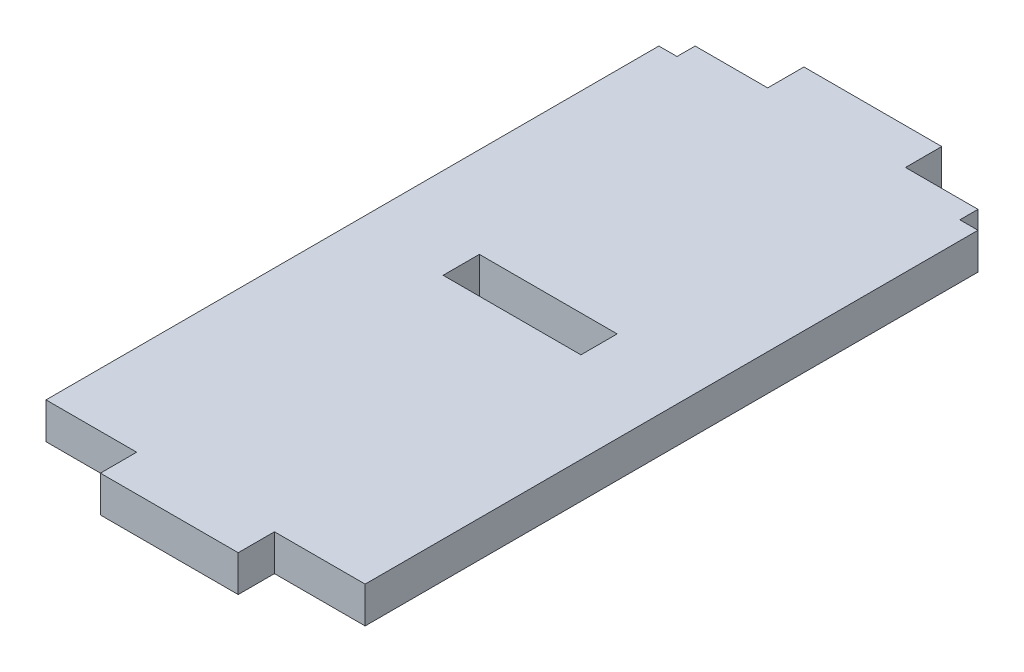
ISO-10303-21;
HEADER;
FILE_DESCRIPTION(('STEP AP214'),'2;1');
FILE_NAME('part.step','',(''),(''),'','','');
FILE_SCHEMA(('AUTOMOTIVE_DESIGN { 1 0 10303 214 1 1 1 1 }'));
ENDSEC;
DATA;
#1=APPLICATION_CONTEXT('core data for automotive mechanical design processes');
#2=APPLICATION_PROTOCOL_DEFINITION('international standard','automotive_design',2000,#1);
#3=PRODUCT_CONTEXT('',#1,'mechanical');
#4=PRODUCT('Part','Part','',(#3));
#5=PRODUCT_RELATED_PRODUCT_CATEGORY('part','',(#4));
#6=PRODUCT_DEFINITION_FORMATION('','',#4);
#7=PRODUCT_DEFINITION_CONTEXT('part definition',#1,'design');
#8=PRODUCT_DEFINITION('design','',#6,#7);
#9=PRODUCT_DEFINITION_SHAPE('','',#8);
#10=(LENGTH_UNIT() NAMED_UNIT(*) SI_UNIT(.MILLI.,.METRE.));
#11=(NAMED_UNIT(*) PLANE_ANGLE_UNIT() SI_UNIT($,.RADIAN.));
#12=(NAMED_UNIT(*) SI_UNIT($,.STERADIAN.) SOLID_ANGLE_UNIT());
#13=UNCERTAINTY_MEASURE_WITH_UNIT(LENGTH_MEASURE(1.E-05),#10,'distance_accuracy_value','');
#14=(GEOMETRIC_REPRESENTATION_CONTEXT(3) GLOBAL_UNCERTAINTY_ASSIGNED_CONTEXT((#13)) GLOBAL_UNIT_ASSIGNED_CONTEXT((#10,
#11,#12)) REPRESENTATION_CONTEXT('',''));
#15=CARTESIAN_POINT('',(0.,0.,0.));
#16=DIRECTION('',(0.,0.,1.));
#17=DIRECTION('',(1.,0.,0.));
#18=AXIS2_PLACEMENT_3D('',#15,#16,#17);
#19=CARTESIAN_POINT('',(0.,2.,-18.9));
#20=DIRECTION('',(0.,0.,-1.));
#21=DIRECTION('',(-1.,0.,0.));
#22=AXIS2_PLACEMENT_3D('',#19,#20,#21);
#23=PLANE('',#22);
#24=DIRECTION('',(1.,0.,0.));
#25=VECTOR('',#24,1.);
#26=CARTESIAN_POINT('',(0.,0.,-18.9));
#27=LINE('',#26,#25);
#28=CARTESIAN_POINT('',(5.,0.,-18.9));
#29=VERTEX_POINT('',#28);
#30=CARTESIAN_POINT('',(12.6,0.,-18.9));
#31=VERTEX_POINT('',#30);
#32=EDGE_CURVE('E244',#29,#31,#27,.T.);
#33=ORIENTED_EDGE('',*,*,#32,.T.);
#34=DIRECTION('',(0.,-1.,0.));
#35=VECTOR('',#34,1.);
#36=CARTESIAN_POINT('',(12.6,2.,-18.9));
#37=LINE('',#36,#35);
#38=CARTESIAN_POINT('',(12.6,2.,-18.9));
#39=VERTEX_POINT('',#38);
#40=EDGE_CURVE('E11',#39,#31,#37,.T.);
#41=ORIENTED_EDGE('',*,*,#40,.F.);
#42=DIRECTION('',(1.,0.,0.));
#43=VECTOR('',#42,1.);
#44=CARTESIAN_POINT('',(0.,2.,-18.9));
#45=LINE('',#44,#43);
#46=CARTESIAN_POINT('',(5.,2.,-18.9));
#47=VERTEX_POINT('',#46);
#48=EDGE_CURVE('E186',#47,#39,#45,.T.);
#49=ORIENTED_EDGE('',*,*,#48,.F.);
#50=DIRECTION('',(0.,-1.,0.));
#51=VECTOR('',#50,1.);
#52=CARTESIAN_POINT('',(5.,2.,-18.9));
#53=LINE('',#52,#51);
#54=EDGE_CURVE('E54',#47,#29,#53,.T.);
#55=ORIENTED_EDGE('',*,*,#54,.T.);
#56=EDGE_LOOP('',(#33,#41,#49,#55));
#57=FACE_BOUND('',#56,.T.);
#58=ADVANCED_FACE('F35',(#57),#23,.F.);
#59=CARTESIAN_POINT('',(12.6,2.,0.));
#60=DIRECTION('',(1.,0.,0.));
#61=DIRECTION('',(0.,0.,-1.));
#62=AXIS2_PLACEMENT_3D('',#59,#60,#61);
#63=PLANE('',#62);
#64=DIRECTION('',(0.,0.,1.));
#65=VECTOR('',#64,1.);
#66=CARTESIAN_POINT('',(12.6,0.,0.));
#67=LINE('',#66,#65);
#68=CARTESIAN_POINT('',(12.6,0.,-16.9));
#69=VERTEX_POINT('',#68);
#70=EDGE_CURVE('E192',#31,#69,#67,.T.);
#71=ORIENTED_EDGE('',*,*,#70,.T.);
#72=DIRECTION('',(0.,-1.,0.));
#73=VECTOR('',#72,1.);
#74=CARTESIAN_POINT('',(12.6,2.,-16.9));
#75=LINE('',#74,#73);
#76=CARTESIAN_POINT('',(12.6,2.,-16.9));
#77=VERTEX_POINT('',#76);
#78=EDGE_CURVE('E45',#77,#69,#75,.T.);
#79=ORIENTED_EDGE('',*,*,#78,.F.);
#80=DIRECTION('',(0.,0.,1.));
#81=VECTOR('',#80,1.);
#82=CARTESIAN_POINT('',(12.6,2.,0.));
#83=LINE('',#82,#81);
#84=EDGE_CURVE('E180',#39,#77,#83,.T.);
#85=ORIENTED_EDGE('',*,*,#84,.F.);
#86=ORIENTED_EDGE('',*,*,#40,.T.);
#87=EDGE_LOOP('',(#71,#79,#85,#86));
#88=FACE_BOUND('',#87,.T.);
#89=ADVANCED_FACE('F191',(#88),#63,.F.);
#90=CARTESIAN_POINT('',(0.,2.,-16.9));
#91=DIRECTION('',(0.,0.,-1.));
#92=DIRECTION('',(-1.,0.,0.));
#93=AXIS2_PLACEMENT_3D('',#90,#91,#92);
#94=PLANE('',#93);
#95=DIRECTION('',(1.,0.,0.));
#96=VECTOR('',#95,1.);
#97=CARTESIAN_POINT('',(0.,0.,-16.9));
#98=LINE('',#97,#96);
#99=CARTESIAN_POINT('',(5.,0.,-16.9));
#100=VERTEX_POINT('',#99);
#101=EDGE_CURVE('E247',#100,#69,#98,.T.);
#102=ORIENTED_EDGE('',*,*,#101,.F.);
#103=DIRECTION('',(0.,-1.,0.));
#104=VECTOR('',#103,1.);
#105=CARTESIAN_POINT('',(5.,2.,-16.9));
#106=LINE('',#105,#104);
#107=CARTESIAN_POINT('',(5.,2.,-16.9));
#108=VERTEX_POINT('',#107);
#109=EDGE_CURVE('E116',#108,#100,#106,.T.);
#110=ORIENTED_EDGE('',*,*,#109,.F.);
#111=DIRECTION('',(1.,0.,0.));
#112=VECTOR('',#111,1.);
#113=CARTESIAN_POINT('',(0.,2.,-16.9));
#114=LINE('',#113,#112);
#115=EDGE_CURVE('E185',#108,#77,#114,.T.);
#116=ORIENTED_EDGE('',*,*,#115,.T.);
#117=ORIENTED_EDGE('',*,*,#78,.T.);
#118=EDGE_LOOP('',(#102,#110,#116,#117));
#119=FACE_BOUND('',#118,.T.);
#120=ADVANCED_FACE('F196',(#119),#94,.T.);
#121=CARTESIAN_POINT('',(16.6,2.,0.));
#122=DIRECTION('',(1.,0.,0.));
#123=DIRECTION('',(0.,0.,-1.));
#124=AXIS2_PLACEMENT_3D('',#121,#122,#123);
#125=PLANE('',#124);
#126=DIRECTION('',(0.,0.,1.));
#127=VECTOR('',#126,1.);
#128=CARTESIAN_POINT('',(16.6,0.,0.));
#129=LINE('',#128,#127);
#130=CARTESIAN_POINT('',(16.6,0.,-34.8));
#131=VERTEX_POINT('',#130);
#132=CARTESIAN_POINT('',(16.6,0.,-33.8));
#133=VERTEX_POINT('',#132);
#134=EDGE_CURVE('E203',#131,#133,#129,.T.);
#135=ORIENTED_EDGE('',*,*,#134,.F.);
#136=DIRECTION('',(0.,-1.,0.));
#137=VECTOR('',#136,1.);
#138=CARTESIAN_POINT('',(16.6,2.,-34.8));
#139=LINE('',#138,#137);
#140=CARTESIAN_POINT('',(16.6,2.,-34.8));
#141=VERTEX_POINT('',#140);
#142=EDGE_CURVE('E39',#141,#131,#139,.T.);
#143=ORIENTED_EDGE('',*,*,#142,.F.);
#144=DIRECTION('',(0.,0.,1.));
#145=VECTOR('',#144,1.);
#146=CARTESIAN_POINT('',(16.6,2.,0.));
#147=LINE('',#146,#145);
#148=CARTESIAN_POINT('',(16.6,2.,-33.8));
#149=VERTEX_POINT('',#148);
#150=EDGE_CURVE('E252',#141,#149,#147,.T.);
#151=ORIENTED_EDGE('',*,*,#150,.T.);
#152=DIRECTION('',(0.,-1.,0.));
#153=VECTOR('',#152,1.);
#154=CARTESIAN_POINT('',(16.6,2.,-33.8));
#155=LINE('',#154,#153);
#156=EDGE_CURVE('E199',#149,#133,#155,.T.);
#157=ORIENTED_EDGE('',*,*,#156,.T.);
#158=EDGE_LOOP('',(#135,#143,#151,#157));
#159=FACE_BOUND('',#158,.T.);
#160=ADVANCED_FACE('F37',(#159),#125,.T.);
#161=CARTESIAN_POINT('',(0.,2.,-34.8));
#162=DIRECTION('',(0.,0.,-1.));
#163=DIRECTION('',(-1.,0.,0.));
#164=AXIS2_PLACEMENT_3D('',#161,#162,#163);
#165=PLANE('',#164);
#166=DIRECTION('',(1.,0.,0.));
#167=VECTOR('',#166,1.);
#168=CARTESIAN_POINT('',(0.,0.,-34.8));
#169=LINE('',#168,#167);
#170=CARTESIAN_POINT('',(12.6,0.,-34.8));
#171=VERTEX_POINT('',#170);
#172=EDGE_CURVE('E206',#171,#131,#169,.T.);
#173=ORIENTED_EDGE('',*,*,#172,.F.);
#174=DIRECTION('',(0.,-1.,0.));
#175=VECTOR('',#174,1.);
#176=CARTESIAN_POINT('',(12.6,2.,-34.8));
#177=LINE('',#176,#175);
#178=CARTESIAN_POINT('',(12.6,2.,-34.8));
#179=VERTEX_POINT('',#178);
#180=EDGE_CURVE('E285',#179,#171,#177,.T.);
#181=ORIENTED_EDGE('',*,*,#180,.F.);
#182=DIRECTION('',(1.,0.,0.));
#183=VECTOR('',#182,1.);
#184=CARTESIAN_POINT('',(0.,2.,-34.8));
#185=LINE('',#184,#183);
#186=EDGE_CURVE('E294',#179,#141,#185,.T.);
#187=ORIENTED_EDGE('',*,*,#186,.T.);
#188=ORIENTED_EDGE('',*,*,#142,.T.);
#189=EDGE_LOOP('',(#173,#181,#187,#188));
#190=FACE_BOUND('',#189,.T.);
#191=ADVANCED_FACE('F292',(#190),#165,.T.);
#192=CARTESIAN_POINT('',(12.6,2.,0.));
#193=DIRECTION('',(1.,0.,0.));
#194=DIRECTION('',(0.,0.,-1.));
#195=AXIS2_PLACEMENT_3D('',#192,#193,#194);
#196=PLANE('',#195);
#197=DIRECTION('',(0.,0.,1.));
#198=VECTOR('',#197,1.);
#199=CARTESIAN_POINT('',(12.6,0.,0.));
#200=LINE('',#199,#198);
#201=CARTESIAN_POINT('',(12.6,0.,-36.8));
#202=VERTEX_POINT('',#201);
#203=EDGE_CURVE('E209',#202,#171,#200,.T.);
#204=ORIENTED_EDGE('',*,*,#203,.F.);
#205=DIRECTION('',(0.,-1.,0.));
#206=VECTOR('',#205,1.);
#207=CARTESIAN_POINT('',(12.6,2.,-36.8));
#208=LINE('',#207,#206);
#209=CARTESIAN_POINT('',(12.6,2.,-36.8));
#210=VERTEX_POINT('',#209);
#211=EDGE_CURVE('E284',#210,#202,#208,.T.);
#212=ORIENTED_EDGE('',*,*,#211,.F.);
#213=DIRECTION('',(0.,0.,1.));
#214=VECTOR('',#213,1.);
#215=CARTESIAN_POINT('',(12.6,2.,0.));
#216=LINE('',#215,#214);
#217=EDGE_CURVE('E304',#210,#179,#216,.T.);
#218=ORIENTED_EDGE('',*,*,#217,.T.);
#219=ORIENTED_EDGE('',*,*,#180,.T.);
#220=EDGE_LOOP('',(#204,#212,#218,#219));
#221=FACE_BOUND('',#220,.T.);
#222=ADVANCED_FACE('F302',(#221),#196,.T.);
#223=CARTESIAN_POINT('',(0.,2.,-36.8));
#224=DIRECTION('',(0.,0.,-1.));
#225=DIRECTION('',(-1.,0.,0.));
#226=AXIS2_PLACEMENT_3D('',#223,#224,#225);
#227=PLANE('',#226);
#228=DIRECTION('',(1.,0.,0.));
#229=VECTOR('',#228,1.);
#230=CARTESIAN_POINT('',(0.,0.,-36.8));
#231=LINE('',#230,#229);
#232=CARTESIAN_POINT('',(5.,0.,-36.8));
#233=VERTEX_POINT('',#232);
#234=EDGE_CURVE('E213',#233,#202,#231,.T.);
#235=ORIENTED_EDGE('',*,*,#234,.F.);
#236=DIRECTION('',(0.,-1.,0.));
#237=VECTOR('',#236,1.);
#238=CARTESIAN_POINT('',(5.,2.,-36.8));
#239=LINE('',#238,#237);
#240=CARTESIAN_POINT('',(5.,2.,-36.8));
#241=VERTEX_POINT('',#240);
#242=EDGE_CURVE('E282',#241,#233,#239,.T.);
#243=ORIENTED_EDGE('',*,*,#242,.F.);
#244=DIRECTION('',(1.,0.,0.));
#245=VECTOR('',#244,1.);
#246=CARTESIAN_POINT('',(0.,2.,-36.8));
#247=LINE('',#246,#245);
#248=EDGE_CURVE('E309',#241,#210,#247,.T.);
#249=ORIENTED_EDGE('',*,*,#248,.T.);
#250=ORIENTED_EDGE('',*,*,#211,.T.);
#251=EDGE_LOOP('',(#235,#243,#249,#250));
#252=FACE_BOUND('',#251,.T.);
#253=ADVANCED_FACE('F311',(#252),#227,.T.);
#254=CARTESIAN_POINT('',(5.,2.,0.));
#255=DIRECTION('',(1.,0.,0.));
#256=DIRECTION('',(0.,0.,-1.));
#257=AXIS2_PLACEMENT_3D('',#254,#255,#256);
#258=PLANE('',#257);
#259=DIRECTION('',(0.,0.,1.));
#260=VECTOR('',#259,1.);
#261=CARTESIAN_POINT('',(5.,0.,0.));
#262=LINE('',#261,#260);
#263=CARTESIAN_POINT('',(5.,0.,-34.8));
#264=VERTEX_POINT('',#263);
#265=EDGE_CURVE('E216',#233,#264,#262,.T.);
#266=ORIENTED_EDGE('',*,*,#265,.T.);
#267=DIRECTION('',(0.,-1.,0.));
#268=VECTOR('',#267,1.);
#269=CARTESIAN_POINT('',(5.,2.,-34.8));
#270=LINE('',#269,#268);
#271=CARTESIAN_POINT('',(5.,2.,-34.8));
#272=VERTEX_POINT('',#271);
#273=EDGE_CURVE('E280',#272,#264,#270,.T.);
#274=ORIENTED_EDGE('',*,*,#273,.F.);
#275=DIRECTION('',(0.,0.,1.));
#276=VECTOR('',#275,1.);
#277=CARTESIAN_POINT('',(5.,2.,0.));
#278=LINE('',#277,#276);
#279=EDGE_CURVE('E313',#241,#272,#278,.T.);
#280=ORIENTED_EDGE('',*,*,#279,.F.);
#281=ORIENTED_EDGE('',*,*,#242,.T.);
#282=EDGE_LOOP('',(#266,#274,#280,#281));
#283=FACE_BOUND('',#282,.T.);
#284=ADVANCED_FACE('F356',(#283),#258,.F.);
#285=CARTESIAN_POINT('',(1.,0.,-34.8));
#286=VERTEX_POINT('',#285);
#287=EDGE_CURVE('E210',#286,#264,#169,.T.);
#288=ORIENTED_EDGE('',*,*,#287,.F.);
#289=DIRECTION('',(0.,-1.,0.));
#290=VECTOR('',#289,1.);
#291=CARTESIAN_POINT('',(1.,2.,-34.8));
#292=LINE('',#291,#290);
#293=CARTESIAN_POINT('',(1.,2.,-34.8));
#294=VERTEX_POINT('',#293);
#295=EDGE_CURVE('E278',#294,#286,#292,.T.);
#296=ORIENTED_EDGE('',*,*,#295,.F.);
#297=EDGE_CURVE('E315',#294,#272,#185,.T.);
#298=ORIENTED_EDGE('',*,*,#297,.T.);
#299=ORIENTED_EDGE('',*,*,#273,.T.);
#300=EDGE_LOOP('',(#288,#296,#298,#299));
#301=FACE_BOUND('',#300,.T.);
#302=ADVANCED_FACE('F350',(#301),#165,.T.);
#303=CARTESIAN_POINT('',(1.00000000000001,2.,0.));
#304=DIRECTION('',(1.,0.,0.));
#305=DIRECTION('',(0.,0.,-1.));
#306=AXIS2_PLACEMENT_3D('',#303,#304,#305);
#307=PLANE('',#306);
#308=DIRECTION('',(0.,0.,1.));
#309=VECTOR('',#308,1.);
#310=CARTESIAN_POINT('',(1.00000000000001,0.,0.));
#311=LINE('',#310,#309);
#312=CARTESIAN_POINT('',(1.,0.,-33.8));
#313=VERTEX_POINT('',#312);
#314=EDGE_CURVE('E219',#286,#313,#311,.T.);
#315=ORIENTED_EDGE('',*,*,#314,.T.);
#316=DIRECTION('',(0.,-1.,0.));
#317=VECTOR('',#316,1.);
#318=CARTESIAN_POINT('',(1.,2.,-33.8));
#319=LINE('',#318,#317);
#320=CARTESIAN_POINT('',(1.,2.,-33.8));
#321=VERTEX_POINT('',#320);
#322=EDGE_CURVE('E276',#321,#313,#319,.T.);
#323=ORIENTED_EDGE('',*,*,#322,.F.);
#324=DIRECTION('',(0.,0.,1.));
#325=VECTOR('',#324,1.);
#326=CARTESIAN_POINT('',(1.00000000000001,2.,0.));
#327=LINE('',#326,#325);
#328=EDGE_CURVE('E319',#294,#321,#327,.T.);
#329=ORIENTED_EDGE('',*,*,#328,.F.);
#330=ORIENTED_EDGE('',*,*,#295,.T.);
#331=EDGE_LOOP('',(#315,#323,#329,#330));
#332=FACE_BOUND('',#331,.T.);
#333=ADVANCED_FACE('F361',(#332),#307,.F.);
#334=CARTESIAN_POINT('',(0.,2.,-33.8));
#335=DIRECTION('',(0.,0.,-1.));
#336=DIRECTION('',(-1.,0.,0.));
#337=AXIS2_PLACEMENT_3D('',#334,#335,#336);
#338=PLANE('',#337);
#339=DIRECTION('',(1.,0.,0.));
#340=VECTOR('',#339,1.);
#341=CARTESIAN_POINT('',(0.,0.,-33.8));
#342=LINE('',#341,#340);
#343=CARTESIAN_POINT('',(0.,0.,-33.8));
#344=VERTEX_POINT('',#343);
#345=EDGE_CURVE('E222',#344,#313,#342,.T.);
#346=ORIENTED_EDGE('',*,*,#345,.F.);
#347=DIRECTION('',(0.,-1.,0.));
#348=VECTOR('',#347,1.);
#349=CARTESIAN_POINT('',(0.,2.,-33.8));
#350=LINE('',#349,#348);
#351=CARTESIAN_POINT('',(0.,2.,-33.8));
#352=VERTEX_POINT('',#351);
#353=EDGE_CURVE('E274',#352,#344,#350,.T.);
#354=ORIENTED_EDGE('',*,*,#353,.F.);
#355=DIRECTION('',(1.,0.,0.));
#356=VECTOR('',#355,1.);
#357=CARTESIAN_POINT('',(0.,2.,-33.8));
#358=LINE('',#357,#356);
#359=EDGE_CURVE('E321',#352,#321,#358,.T.);
#360=ORIENTED_EDGE('',*,*,#359,.T.);
#361=ORIENTED_EDGE('',*,*,#322,.T.);
#362=EDGE_LOOP('',(#346,#354,#360,#361));
#363=FACE_BOUND('',#362,.T.);
#364=ADVANCED_FACE('F363',(#363),#338,.T.);
#365=CARTESIAN_POINT('',(0.,2.,0.));
#366=DIRECTION('',(-1.,0.,0.));
#367=DIRECTION('',(0.,0.,1.));
#368=AXIS2_PLACEMENT_3D('',#365,#366,#367);
#369=PLANE('',#368);
#370=DIRECTION('',(0.,0.,-1.));
#371=VECTOR('',#370,1.);
#372=CARTESIAN_POINT('',(0.,0.,0.));
#373=LINE('',#372,#371);
#374=CARTESIAN_POINT('',(0.,0.,0.));
#375=VERTEX_POINT('',#374);
#376=EDGE_CURVE('E225',#375,#344,#373,.T.);
#377=ORIENTED_EDGE('',*,*,#376,.F.);
#378=DIRECTION('',(0.,-1.,0.));
#379=VECTOR('',#378,1.);
#380=CARTESIAN_POINT('',(0.,2.,0.));
#381=LINE('',#380,#379);
#382=CARTESIAN_POINT('',(0.,2.,0.));
#383=VERTEX_POINT('',#382);
#384=EDGE_CURVE('E272',#383,#375,#381,.T.);
#385=ORIENTED_EDGE('',*,*,#384,.F.);
#386=DIRECTION('',(0.,0.,-1.));
#387=VECTOR('',#386,1.);
#388=CARTESIAN_POINT('',(0.,2.,0.));
#389=LINE('',#388,#387);
#390=EDGE_CURVE('E324',#383,#352,#389,.T.);
#391=ORIENTED_EDGE('',*,*,#390,.T.);
#392=ORIENTED_EDGE('',*,*,#353,.T.);
#393=EDGE_LOOP('',(#377,#385,#391,#392));
#394=FACE_BOUND('',#393,.T.);
#395=ADVANCED_FACE('F367',(#394),#369,.T.);
#396=CARTESIAN_POINT('',(0.,2.,0.));
#397=DIRECTION('',(0.,0.,-1.));
#398=DIRECTION('',(-1.,0.,0.));
#399=AXIS2_PLACEMENT_3D('',#396,#397,#398);
#400=PLANE('',#399);
#401=DIRECTION('',(1.,0.,0.));
#402=VECTOR('',#401,1.);
#403=CARTESIAN_POINT('',(0.,0.,0.));
#404=LINE('',#403,#402);
#405=CARTESIAN_POINT('',(5.,0.,0.));
#406=VERTEX_POINT('',#405);
#407=EDGE_CURVE('E228',#375,#406,#404,.T.);
#408=ORIENTED_EDGE('',*,*,#407,.T.);
#409=DIRECTION('',(0.,-1.,0.));
#410=VECTOR('',#409,1.);
#411=CARTESIAN_POINT('',(5.,2.,0.));
#412=LINE('',#411,#410);
#413=CARTESIAN_POINT('',(5.,2.,0.));
#414=VERTEX_POINT('',#413);
#415=EDGE_CURVE('E269',#414,#406,#412,.T.);
#416=ORIENTED_EDGE('',*,*,#415,.F.);
#417=DIRECTION('',(1.,0.,0.));
#418=VECTOR('',#417,1.);
#419=CARTESIAN_POINT('',(0.,2.,0.));
#420=LINE('',#419,#418);
#421=EDGE_CURVE('E327',#383,#414,#420,.T.);
#422=ORIENTED_EDGE('',*,*,#421,.F.);
#423=ORIENTED_EDGE('',*,*,#384,.T.);
#424=EDGE_LOOP('',(#408,#416,#422,#423));
#425=FACE_BOUND('',#424,.T.);
#426=ADVANCED_FACE('F372',(#425),#400,.F.);
#427=CARTESIAN_POINT('',(5.,2.,0.));
#428=DIRECTION('',(1.,0.,0.));
#429=DIRECTION('',(0.,0.,-1.));
#430=AXIS2_PLACEMENT_3D('',#427,#428,#429);
#431=PLANE('',#430);
#432=DIRECTION('',(0.,0.,1.));
#433=VECTOR('',#432,1.);
#434=CARTESIAN_POINT('',(5.,0.,0.));
#435=LINE('',#434,#433);
#436=CARTESIAN_POINT('',(5.,0.,2.));
#437=VERTEX_POINT('',#436);
#438=EDGE_CURVE('E230',#406,#437,#435,.T.);
#439=ORIENTED_EDGE('',*,*,#438,.T.);
#440=DIRECTION('',(0.,-1.,0.));
#441=VECTOR('',#440,1.);
#442=CARTESIAN_POINT('',(5.,2.,2.));
#443=LINE('',#442,#441);
#444=CARTESIAN_POINT('',(5.,2.,2.));
#445=VERTEX_POINT('',#444);
#446=EDGE_CURVE('E266',#445,#437,#443,.T.);
#447=ORIENTED_EDGE('',*,*,#446,.F.);
#448=DIRECTION('',(0.,0.,1.));
#449=VECTOR('',#448,1.);
#450=CARTESIAN_POINT('',(5.,2.,0.));
#451=LINE('',#450,#449);
#452=EDGE_CURVE('E329',#414,#445,#451,.T.);
#453=ORIENTED_EDGE('',*,*,#452,.F.);
#454=ORIENTED_EDGE('',*,*,#415,.T.);
#455=EDGE_LOOP('',(#439,#447,#453,#454));
#456=FACE_BOUND('',#455,.T.);
#457=ADVANCED_FACE('F379',(#456),#431,.F.);
#458=CARTESIAN_POINT('',(0.,2.,2.));
#459=DIRECTION('',(0.,0.,-1.));
#460=DIRECTION('',(-1.,0.,0.));
#461=AXIS2_PLACEMENT_3D('',#458,#459,#460);
#462=PLANE('',#461);
#463=DIRECTION('',(1.,0.,0.));
#464=VECTOR('',#463,1.);
#465=CARTESIAN_POINT('',(0.,0.,2.));
#466=LINE('',#465,#464);
#467=CARTESIAN_POINT('',(12.6,0.,2.));
#468=VERTEX_POINT('',#467);
#469=EDGE_CURVE('E233',#437,#468,#466,.T.);
#470=ORIENTED_EDGE('',*,*,#469,.T.);
#471=DIRECTION('',(0.,-1.,0.));
#472=VECTOR('',#471,1.);
#473=CARTESIAN_POINT('',(12.6,2.,2.));
#474=LINE('',#473,#472);
#475=CARTESIAN_POINT('',(12.6,2.,2.));
#476=VERTEX_POINT('',#475);
#477=EDGE_CURVE('E264',#476,#468,#474,.T.);
#478=ORIENTED_EDGE('',*,*,#477,.F.);
#479=DIRECTION('',(1.,0.,0.));
#480=VECTOR('',#479,1.);
#481=CARTESIAN_POINT('',(0.,2.,2.));
#482=LINE('',#481,#480);
#483=EDGE_CURVE('E332',#445,#476,#482,.T.);
#484=ORIENTED_EDGE('',*,*,#483,.F.);
#485=ORIENTED_EDGE('',*,*,#446,.T.);
#486=EDGE_LOOP('',(#470,#478,#484,#485));
#487=FACE_BOUND('',#486,.T.);
#488=ADVANCED_FACE('F383',(#487),#462,.F.);
#489=CARTESIAN_POINT('',(12.6,2.,0.));
#490=DIRECTION('',(1.,0.,0.));
#491=DIRECTION('',(0.,0.,-1.));
#492=AXIS2_PLACEMENT_3D('',#489,#490,#491);
#493=PLANE('',#492);
#494=DIRECTION('',(0.,0.,1.));
#495=VECTOR('',#494,1.);
#496=CARTESIAN_POINT('',(12.6,0.,0.));
#497=LINE('',#496,#495);
#498=CARTESIAN_POINT('',(12.6,0.,0.));
#499=VERTEX_POINT('',#498);
#500=EDGE_CURVE('E236',#499,#468,#497,.T.);
#501=ORIENTED_EDGE('',*,*,#500,.F.);
#502=DIRECTION('',(0.,-1.,0.));
#503=VECTOR('',#502,1.);
#504=CARTESIAN_POINT('',(12.6,2.,0.));
#505=LINE('',#504,#503);
#506=CARTESIAN_POINT('',(12.6,2.,0.));
#507=VERTEX_POINT('',#506);
#508=EDGE_CURVE('E262',#507,#499,#505,.T.);
#509=ORIENTED_EDGE('',*,*,#508,.F.);
#510=DIRECTION('',(0.,0.,1.));
#511=VECTOR('',#510,1.);
#512=CARTESIAN_POINT('',(12.6,2.,0.));
#513=LINE('',#512,#511);
#514=EDGE_CURVE('E334',#507,#476,#513,.T.);
#515=ORIENTED_EDGE('',*,*,#514,.T.);
#516=ORIENTED_EDGE('',*,*,#477,.T.);
#517=EDGE_LOOP('',(#501,#509,#515,#516));
#518=FACE_BOUND('',#517,.T.);
#519=ADVANCED_FACE('F386',(#518),#493,.T.);
#520=CARTESIAN_POINT('',(17.6,0.,0.));
#521=VERTEX_POINT('',#520);
#522=EDGE_CURVE('E231',#499,#521,#404,.T.);
#523=ORIENTED_EDGE('',*,*,#522,.T.);
#524=DIRECTION('',(0.,-1.,0.));
#525=VECTOR('',#524,1.);
#526=CARTESIAN_POINT('',(17.6,2.,0.));
#527=LINE('',#526,#525);
#528=CARTESIAN_POINT('',(17.6,2.,0.));
#529=VERTEX_POINT('',#528);
#530=EDGE_CURVE('E259',#529,#521,#527,.T.);
#531=ORIENTED_EDGE('',*,*,#530,.F.);
#532=EDGE_CURVE('E330',#507,#529,#420,.T.);
#533=ORIENTED_EDGE('',*,*,#532,.F.);
#534=ORIENTED_EDGE('',*,*,#508,.T.);
#535=EDGE_LOOP('',(#523,#531,#533,#534));
#536=FACE_BOUND('',#535,.T.);
#537=ADVANCED_FACE('F390',(#536),#400,.F.);
#538=CARTESIAN_POINT('',(17.6,2.,0.));
#539=DIRECTION('',(-1.,0.,0.));
#540=DIRECTION('',(0.,0.,1.));
#541=AXIS2_PLACEMENT_3D('',#538,#539,#540);
#542=PLANE('',#541);
#543=DIRECTION('',(0.,0.,-1.));
#544=VECTOR('',#543,1.);
#545=CARTESIAN_POINT('',(17.6,0.,0.));
#546=LINE('',#545,#544);
#547=CARTESIAN_POINT('',(17.6,0.,-33.8));
#548=VERTEX_POINT('',#547);
#549=EDGE_CURVE('E239',#521,#548,#546,.T.);
#550=ORIENTED_EDGE('',*,*,#549,.T.);
#551=DIRECTION('',(0.,-1.,0.));
#552=VECTOR('',#551,1.);
#553=CARTESIAN_POINT('',(17.6,2.,-33.8));
#554=LINE('',#553,#552);
#555=CARTESIAN_POINT('',(17.6,2.,-33.8));
#556=VERTEX_POINT('',#555);
#557=EDGE_CURVE('E256',#556,#548,#554,.T.);
#558=ORIENTED_EDGE('',*,*,#557,.F.);
#559=DIRECTION('',(0.,0.,-1.));
#560=VECTOR('',#559,1.);
#561=CARTESIAN_POINT('',(17.6,2.,0.));
#562=LINE('',#561,#560);
#563=EDGE_CURVE('E337',#529,#556,#562,.T.);
#564=ORIENTED_EDGE('',*,*,#563,.F.);
#565=ORIENTED_EDGE('',*,*,#530,.T.);
#566=EDGE_LOOP('',(#550,#558,#564,#565));
#567=FACE_BOUND('',#566,.T.);
#568=ADVANCED_FACE('F394',(#567),#542,.F.);
#569=CARTESIAN_POINT('',(0.,2.,-33.8));
#570=DIRECTION('',(0.,0.,1.));
#571=DIRECTION('',(1.,0.,0.));
#572=AXIS2_PLACEMENT_3D('',#569,#570,#571);
#573=PLANE('',#572);
#574=DIRECTION('',(-1.,0.,0.));
#575=VECTOR('',#574,1.);
#576=CARTESIAN_POINT('',(0.,0.,-33.8));
#577=LINE('',#576,#575);
#578=EDGE_CURVE('E241',#548,#133,#577,.T.);
#579=ORIENTED_EDGE('',*,*,#578,.T.);
#580=ORIENTED_EDGE('',*,*,#156,.F.);
#581=DIRECTION('',(-1.,0.,0.));
#582=VECTOR('',#581,1.);
#583=CARTESIAN_POINT('',(0.,2.,-33.8));
#584=LINE('',#583,#582);
#585=EDGE_CURVE('E339',#556,#149,#584,.T.);
#586=ORIENTED_EDGE('',*,*,#585,.F.);
#587=ORIENTED_EDGE('',*,*,#557,.T.);
#588=EDGE_LOOP('',(#579,#580,#586,#587));
#589=FACE_BOUND('',#588,.T.);
#590=ADVANCED_FACE('F344',(#589),#573,.F.);
#591=CARTESIAN_POINT('',(5.,2.,0.));
#592=DIRECTION('',(1.,0.,0.));
#593=DIRECTION('',(0.,0.,-1.));
#594=AXIS2_PLACEMENT_3D('',#591,#592,#593);
#595=PLANE('',#594);
#596=DIRECTION('',(0.,0.,1.));
#597=VECTOR('',#596,1.);
#598=CARTESIAN_POINT('',(5.,0.,0.));
#599=LINE('',#598,#597);
#600=EDGE_CURVE('E249',#29,#100,#599,.T.);
#601=ORIENTED_EDGE('',*,*,#600,.F.);
#602=ORIENTED_EDGE('',*,*,#54,.F.);
#603=DIRECTION('',(0.,0.,1.));
#604=VECTOR('',#603,1.);
#605=CARTESIAN_POINT('',(5.,2.,0.));
#606=LINE('',#605,#604);
#607=EDGE_CURVE('E197',#47,#108,#606,.T.);
#608=ORIENTED_EDGE('',*,*,#607,.T.);
#609=ORIENTED_EDGE('',*,*,#109,.T.);
#610=EDGE_LOOP('',(#601,#602,#608,#609));
#611=FACE_BOUND('',#610,.T.);
#612=ADVANCED_FACE('F401',(#611),#595,.T.);
#613=CARTESIAN_POINT('',(0.,2.,0.));
#614=DIRECTION('',(0.,1.,0.));
#615=DIRECTION('',(0.,0.,1.));
#616=AXIS2_PLACEMENT_3D('',#613,#614,#615);
#617=PLANE('',#616);
#618=ORIENTED_EDGE('',*,*,#150,.F.);
#619=ORIENTED_EDGE('',*,*,#186,.F.);
#620=ORIENTED_EDGE('',*,*,#217,.F.);
#621=ORIENTED_EDGE('',*,*,#248,.F.);
#622=ORIENTED_EDGE('',*,*,#279,.T.);
#623=ORIENTED_EDGE('',*,*,#297,.F.);
#624=ORIENTED_EDGE('',*,*,#328,.T.);
#625=ORIENTED_EDGE('',*,*,#359,.F.);
#626=ORIENTED_EDGE('',*,*,#390,.F.);
#627=ORIENTED_EDGE('',*,*,#421,.T.);
#628=ORIENTED_EDGE('',*,*,#452,.T.);
#629=ORIENTED_EDGE('',*,*,#483,.T.);
#630=ORIENTED_EDGE('',*,*,#514,.F.);
#631=ORIENTED_EDGE('',*,*,#532,.T.);
#632=ORIENTED_EDGE('',*,*,#563,.T.);
#633=ORIENTED_EDGE('',*,*,#585,.T.);
#634=EDGE_LOOP('',(#618,#619,#620,#621,#622,#623,#624,#625,#626,#627,#628,#629,#630,#631,#632,#633));
#635=FACE_BOUND('',#634,.T.);
#636=ORIENTED_EDGE('',*,*,#48,.T.);
#637=ORIENTED_EDGE('',*,*,#84,.T.);
#638=ORIENTED_EDGE('',*,*,#115,.F.);
#639=ORIENTED_EDGE('',*,*,#607,.F.);
#640=EDGE_LOOP('',(#636,#637,#638,#639));
#641=FACE_BOUND('',#640,.T.);
#642=ADVANCED_FACE('F182',(#635,#641),#617,.T.);
#643=CARTESIAN_POINT('',(0.,0.,0.));
#644=DIRECTION('',(0.,1.,0.));
#645=DIRECTION('',(0.,0.,1.));
#646=AXIS2_PLACEMENT_3D('',#643,#644,#645);
#647=PLANE('',#646);
#648=ORIENTED_EDGE('',*,*,#134,.T.);
#649=ORIENTED_EDGE('',*,*,#578,.F.);
#650=ORIENTED_EDGE('',*,*,#549,.F.);
#651=ORIENTED_EDGE('',*,*,#522,.F.);
#652=ORIENTED_EDGE('',*,*,#500,.T.);
#653=ORIENTED_EDGE('',*,*,#469,.F.);
#654=ORIENTED_EDGE('',*,*,#438,.F.);
#655=ORIENTED_EDGE('',*,*,#407,.F.);
#656=ORIENTED_EDGE('',*,*,#376,.T.);
#657=ORIENTED_EDGE('',*,*,#345,.T.);
#658=ORIENTED_EDGE('',*,*,#314,.F.);
#659=ORIENTED_EDGE('',*,*,#287,.T.);
#660=ORIENTED_EDGE('',*,*,#265,.F.);
#661=ORIENTED_EDGE('',*,*,#234,.T.);
#662=ORIENTED_EDGE('',*,*,#203,.T.);
#663=ORIENTED_EDGE('',*,*,#172,.T.);
#664=EDGE_LOOP('',(#648,#649,#650,#651,#652,#653,#654,#655,#656,#657,#658,#659,#660,#661,#662,#663));
#665=FACE_BOUND('',#664,.T.);
#666=ORIENTED_EDGE('',*,*,#32,.F.);
#667=ORIENTED_EDGE('',*,*,#600,.T.);
#668=ORIENTED_EDGE('',*,*,#101,.T.);
#669=ORIENTED_EDGE('',*,*,#70,.F.);
#670=EDGE_LOOP('',(#666,#667,#668,#669));
#671=FACE_BOUND('',#670,.T.);
#672=ADVANCED_FACE('F298',(#665,#671),#647,.F.);
#673=CLOSED_SHELL('',(#58,#89,#120,#160,#191,#222,#253,#284,#302,#333,#364,#395,#426,#457,#488,
#519,#537,#568,#590,#612,#642,#672));
#674=MANIFOLD_SOLID_BREP('B2',#673);
#675=ADVANCED_BREP_SHAPE_REPRESENTATION('',(#18,#674),#14);
#676=SHAPE_DEFINITION_REPRESENTATION(#9,#675);
ENDSEC;
END-ISO-10303-21;
